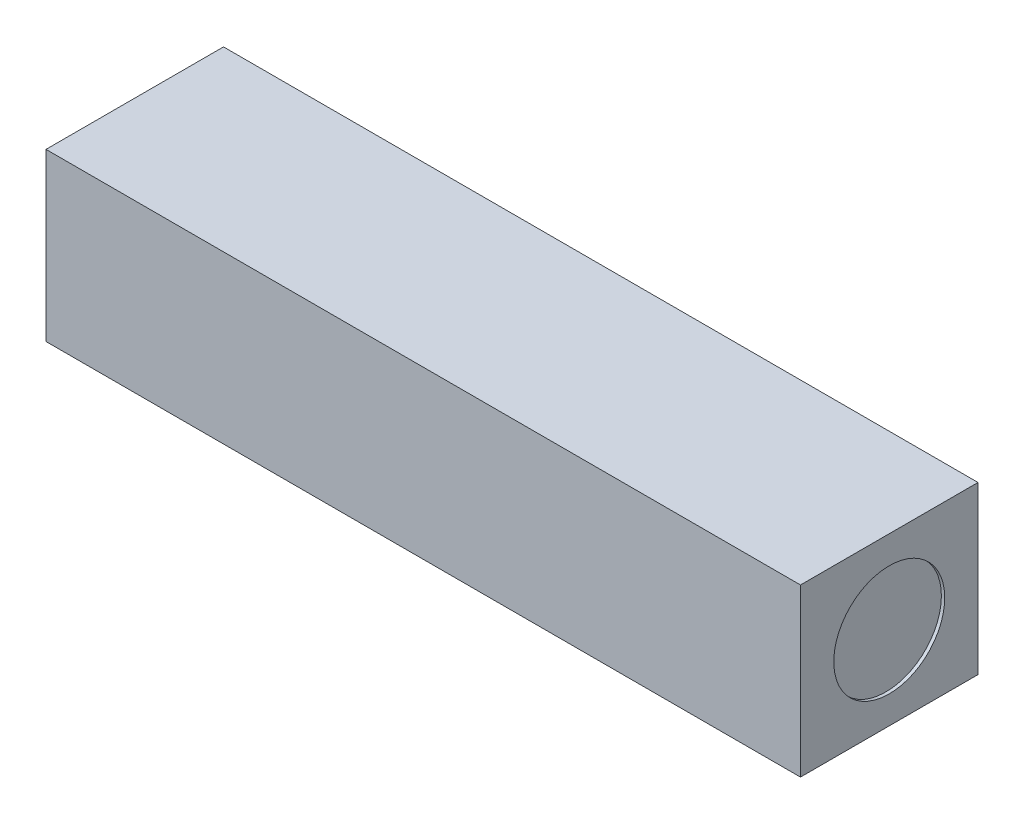
ISO-10303-21;
HEADER;
FILE_DESCRIPTION(('STEP AP214'),'2;1');
FILE_NAME('part.step','',(''),(''),'','','');
FILE_SCHEMA(('AUTOMOTIVE_DESIGN { 1 0 10303 214 1 1 1 1 }'));
ENDSEC;
DATA;
#1=APPLICATION_CONTEXT('core data for automotive mechanical design processes');
#2=APPLICATION_PROTOCOL_DEFINITION('international standard','automotive_design',2000,#1);
#3=PRODUCT_CONTEXT('',#1,'mechanical');
#4=PRODUCT('Part','Part','',(#3));
#5=PRODUCT_RELATED_PRODUCT_CATEGORY('part','',(#4));
#6=PRODUCT_DEFINITION_FORMATION('','',#4);
#7=PRODUCT_DEFINITION_CONTEXT('part definition',#1,'design');
#8=PRODUCT_DEFINITION('design','',#6,#7);
#9=PRODUCT_DEFINITION_SHAPE('','',#8);
#10=(LENGTH_UNIT() NAMED_UNIT(*) SI_UNIT(.MILLI.,.METRE.));
#11=(NAMED_UNIT(*) PLANE_ANGLE_UNIT() SI_UNIT($,.RADIAN.));
#12=(NAMED_UNIT(*) SI_UNIT($,.STERADIAN.) SOLID_ANGLE_UNIT());
#13=UNCERTAINTY_MEASURE_WITH_UNIT(LENGTH_MEASURE(1.E-05),#10,'distance_accuracy_value','');
#14=(GEOMETRIC_REPRESENTATION_CONTEXT(3) GLOBAL_UNCERTAINTY_ASSIGNED_CONTEXT((#13)) GLOBAL_UNIT_ASSIGNED_CONTEXT((#10,
#11,#12)) REPRESENTATION_CONTEXT('',''));
#15=CARTESIAN_POINT('',(0.,0.,0.));
#16=DIRECTION('',(0.,0.,1.));
#17=DIRECTION('',(1.,0.,0.));
#18=AXIS2_PLACEMENT_3D('',#15,#16,#17);
#19=CARTESIAN_POINT('',(-17.,7.5,4.));
#20=DIRECTION('',(0.,0.,-1.));
#21=DIRECTION('',(-1.,0.,0.));
#22=AXIS2_PLACEMENT_3D('',#19,#20,#21);
#23=PLANE('',#22);
#24=DIRECTION('',(1.,0.,0.));
#25=VECTOR('',#24,1.);
#26=CARTESIAN_POINT('',(-17.,0.,4.));
#27=LINE('',#26,#25);
#28=CARTESIAN_POINT('',(-17.,0.,4.));
#29=VERTEX_POINT('',#28);
#30=CARTESIAN_POINT('',(17.,0.,4.));
#31=VERTEX_POINT('',#30);
#32=EDGE_CURVE('E97',#29,#31,#27,.T.);
#33=ORIENTED_EDGE('',*,*,#32,.T.);
#34=DIRECTION('',(0.,-1.,0.));
#35=VECTOR('',#34,1.);
#36=CARTESIAN_POINT('',(17.,7.5,4.));
#37=LINE('',#36,#35);
#38=CARTESIAN_POINT('',(17.,7.5,4.));
#39=VERTEX_POINT('',#38);
#40=EDGE_CURVE('E11',#39,#31,#37,.T.);
#41=ORIENTED_EDGE('',*,*,#40,.F.);
#42=DIRECTION('',(1.,0.,0.));
#43=VECTOR('',#42,1.);
#44=CARTESIAN_POINT('',(-17.,7.5,4.));
#45=LINE('',#44,#43);
#46=CARTESIAN_POINT('',(-17.,7.5,4.));
#47=VERTEX_POINT('',#46);
#48=EDGE_CURVE('E85',#47,#39,#45,.T.);
#49=ORIENTED_EDGE('',*,*,#48,.F.);
#50=DIRECTION('',(0.,-1.,0.));
#51=VECTOR('',#50,1.);
#52=CARTESIAN_POINT('',(-17.,7.5,4.));
#53=LINE('',#52,#51);
#54=EDGE_CURVE('E93',#47,#29,#53,.T.);
#55=ORIENTED_EDGE('',*,*,#54,.T.);
#56=EDGE_LOOP('',(#33,#41,#49,#55));
#57=FACE_BOUND('',#56,.T.);
#58=ADVANCED_FACE('F34',(#57),#23,.F.);
#59=CARTESIAN_POINT('',(17.,7.5,4.));
#60=DIRECTION('',(-1.,0.,0.));
#61=DIRECTION('',(0.,0.,1.));
#62=AXIS2_PLACEMENT_3D('',#59,#60,#61);
#63=PLANE('',#62);
#64=CARTESIAN_POINT('',(17.,3.75,0.));
#65=DIRECTION('',(1.,0.,0.));
#66=DIRECTION('',(0.,0.,-1.));
#67=AXIS2_PLACEMENT_3D('',#64,#65,#66);
#68=CIRCLE('',#67,2.5);
#69=CARTESIAN_POINT('',(17.,3.75,-2.5));
#70=VERTEX_POINT('',#69);
#71=EDGE_CURVE('E111',#70,#70,#68,.T.);
#72=ORIENTED_EDGE('',*,*,#71,.F.);
#73=EDGE_LOOP('',(#72));
#74=FACE_BOUND('',#73,.T.);
#75=DIRECTION('',(0.,0.,-1.));
#76=VECTOR('',#75,1.);
#77=CARTESIAN_POINT('',(17.,0.,4.));
#78=LINE('',#77,#76);
#79=CARTESIAN_POINT('',(17.,0.,-4.));
#80=VERTEX_POINT('',#79);
#81=EDGE_CURVE('E89',#31,#80,#78,.T.);
#82=ORIENTED_EDGE('',*,*,#81,.T.);
#83=DIRECTION('',(0.,-1.,0.));
#84=VECTOR('',#83,1.);
#85=CARTESIAN_POINT('',(17.,7.5,-4.));
#86=LINE('',#85,#84);
#87=CARTESIAN_POINT('',(17.,7.5,-4.));
#88=VERTEX_POINT('',#87);
#89=EDGE_CURVE('E42',#88,#80,#86,.T.);
#90=ORIENTED_EDGE('',*,*,#89,.F.);
#91=DIRECTION('',(0.,0.,-1.));
#92=VECTOR('',#91,1.);
#93=CARTESIAN_POINT('',(17.,7.5,4.));
#94=LINE('',#93,#92);
#95=EDGE_CURVE('E80',#39,#88,#94,.T.);
#96=ORIENTED_EDGE('',*,*,#95,.F.);
#97=ORIENTED_EDGE('',*,*,#40,.T.);
#98=EDGE_LOOP('',(#82,#90,#96,#97));
#99=FACE_BOUND('',#98,.T.);
#100=ADVANCED_FACE('F88',(#74,#99),#63,.F.);
#101=CARTESIAN_POINT('',(-17.,7.5,-4.));
#102=DIRECTION('',(0.,0.,1.));
#103=DIRECTION('',(1.,0.,0.));
#104=AXIS2_PLACEMENT_3D('',#101,#102,#103);
#105=PLANE('',#104);
#106=DIRECTION('',(-1.,0.,0.));
#107=VECTOR('',#106,1.);
#108=CARTESIAN_POINT('',(-17.,0.,-4.));
#109=LINE('',#108,#107);
#110=CARTESIAN_POINT('',(-17.,0.,-4.));
#111=VERTEX_POINT('',#110);
#112=EDGE_CURVE('E67',#80,#111,#109,.T.);
#113=ORIENTED_EDGE('',*,*,#112,.T.);
#114=DIRECTION('',(0.,-1.,0.));
#115=VECTOR('',#114,1.);
#116=CARTESIAN_POINT('',(-17.,7.5,-4.));
#117=LINE('',#116,#115);
#118=CARTESIAN_POINT('',(-17.,7.5,-4.));
#119=VERTEX_POINT('',#118);
#120=EDGE_CURVE('E90',#119,#111,#117,.T.);
#121=ORIENTED_EDGE('',*,*,#120,.F.);
#122=DIRECTION('',(-1.,0.,0.));
#123=VECTOR('',#122,1.);
#124=CARTESIAN_POINT('',(-17.,7.5,-4.));
#125=LINE('',#124,#123);
#126=EDGE_CURVE('E83',#88,#119,#125,.T.);
#127=ORIENTED_EDGE('',*,*,#126,.F.);
#128=ORIENTED_EDGE('',*,*,#89,.T.);
#129=EDGE_LOOP('',(#113,#121,#127,#128));
#130=FACE_BOUND('',#129,.T.);
#131=ADVANCED_FACE('F91',(#130),#105,.F.);
#132=CARTESIAN_POINT('',(-17.,7.5,4.));
#133=DIRECTION('',(1.,0.,0.));
#134=DIRECTION('',(0.,0.,-1.));
#135=AXIS2_PLACEMENT_3D('',#132,#133,#134);
#136=PLANE('',#135);
#137=DIRECTION('',(0.,0.,1.));
#138=VECTOR('',#137,1.);
#139=CARTESIAN_POINT('',(-17.,0.,4.));
#140=LINE('',#139,#138);
#141=EDGE_CURVE('E73',#111,#29,#140,.T.);
#142=ORIENTED_EDGE('',*,*,#141,.T.);
#143=ORIENTED_EDGE('',*,*,#54,.F.);
#144=DIRECTION('',(0.,0.,1.));
#145=VECTOR('',#144,1.);
#146=CARTESIAN_POINT('',(-17.,7.5,4.));
#147=LINE('',#146,#145);
#148=EDGE_CURVE('E50',#119,#47,#147,.T.);
#149=ORIENTED_EDGE('',*,*,#148,.F.);
#150=ORIENTED_EDGE('',*,*,#120,.T.);
#151=EDGE_LOOP('',(#142,#143,#149,#150));
#152=FACE_BOUND('',#151,.T.);
#153=ADVANCED_FACE('F105',(#152),#136,.F.);
#154=CARTESIAN_POINT('',(0.,7.5,0.));
#155=DIRECTION('',(0.,1.,0.));
#156=DIRECTION('',(0.,0.,1.));
#157=AXIS2_PLACEMENT_3D('',#154,#155,#156);
#158=PLANE('',#157);
#159=ORIENTED_EDGE('',*,*,#48,.T.);
#160=ORIENTED_EDGE('',*,*,#95,.T.);
#161=ORIENTED_EDGE('',*,*,#126,.T.);
#162=ORIENTED_EDGE('',*,*,#148,.T.);
#163=EDGE_LOOP('',(#159,#160,#161,#162));
#164=FACE_BOUND('',#163,.T.);
#165=ADVANCED_FACE('F81',(#164),#158,.T.);
#166=CARTESIAN_POINT('',(0.,0.,0.));
#167=DIRECTION('',(0.,1.,0.));
#168=DIRECTION('',(0.,0.,1.));
#169=AXIS2_PLACEMENT_3D('',#166,#167,#168);
#170=PLANE('',#169);
#171=ORIENTED_EDGE('',*,*,#32,.F.);
#172=ORIENTED_EDGE('',*,*,#141,.F.);
#173=ORIENTED_EDGE('',*,*,#112,.F.);
#174=ORIENTED_EDGE('',*,*,#81,.F.);
#175=EDGE_LOOP('',(#171,#172,#173,#174));
#176=FACE_BOUND('',#175,.T.);
#177=ADVANCED_FACE('F108',(#176),#170,.F.);
#178=CARTESIAN_POINT('',(16.85,3.75,0.));
#179=DIRECTION('',(1.,0.,0.));
#180=DIRECTION('',(0.,0.,-1.));
#181=AXIS2_PLACEMENT_3D('',#178,#179,#180);
#182=CYLINDRICAL_SURFACE('',#181,2.5);
#183=CARTESIAN_POINT('',(16.85,3.75,0.));
#184=DIRECTION('',(1.,0.,0.));
#185=DIRECTION('',(0.,0.,-1.));
#186=AXIS2_PLACEMENT_3D('',#183,#184,#185);
#187=CIRCLE('',#186,2.5);
#188=CARTESIAN_POINT('',(16.85,3.75,-2.5));
#189=VERTEX_POINT('',#188);
#190=EDGE_CURVE('E100',#189,#189,#187,.T.);
#191=ORIENTED_EDGE('',*,*,#190,.F.);
#192=EDGE_LOOP('',(#191));
#193=FACE_BOUND('',#192,.T.);
#194=ORIENTED_EDGE('',*,*,#71,.T.);
#195=EDGE_LOOP('',(#194));
#196=FACE_BOUND('',#195,.T.);
#197=ADVANCED_FACE('F119',(#193,#196),#182,.F.);
#198=CARTESIAN_POINT('',(16.85,3.75,0.));
#199=DIRECTION('',(1.,0.,0.));
#200=DIRECTION('',(0.,0.,-1.));
#201=AXIS2_PLACEMENT_3D('',#198,#199,#200);
#202=PLANE('',#201);
#203=ORIENTED_EDGE('',*,*,#190,.T.);
#204=EDGE_LOOP('',(#203));
#205=FACE_BOUND('',#204,.T.);
#206=ADVANCED_FACE('F117',(#205),#202,.T.);
#207=CLOSED_SHELL('',(#58,#100,#131,#153,#165,#177,#197,#206));
#208=MANIFOLD_SOLID_BREP('B2',#207);
#209=ADVANCED_BREP_SHAPE_REPRESENTATION('',(#18,#208),#14);
#210=SHAPE_DEFINITION_REPRESENTATION(#9,#209);
ENDSEC;
END-ISO-10303-21;
